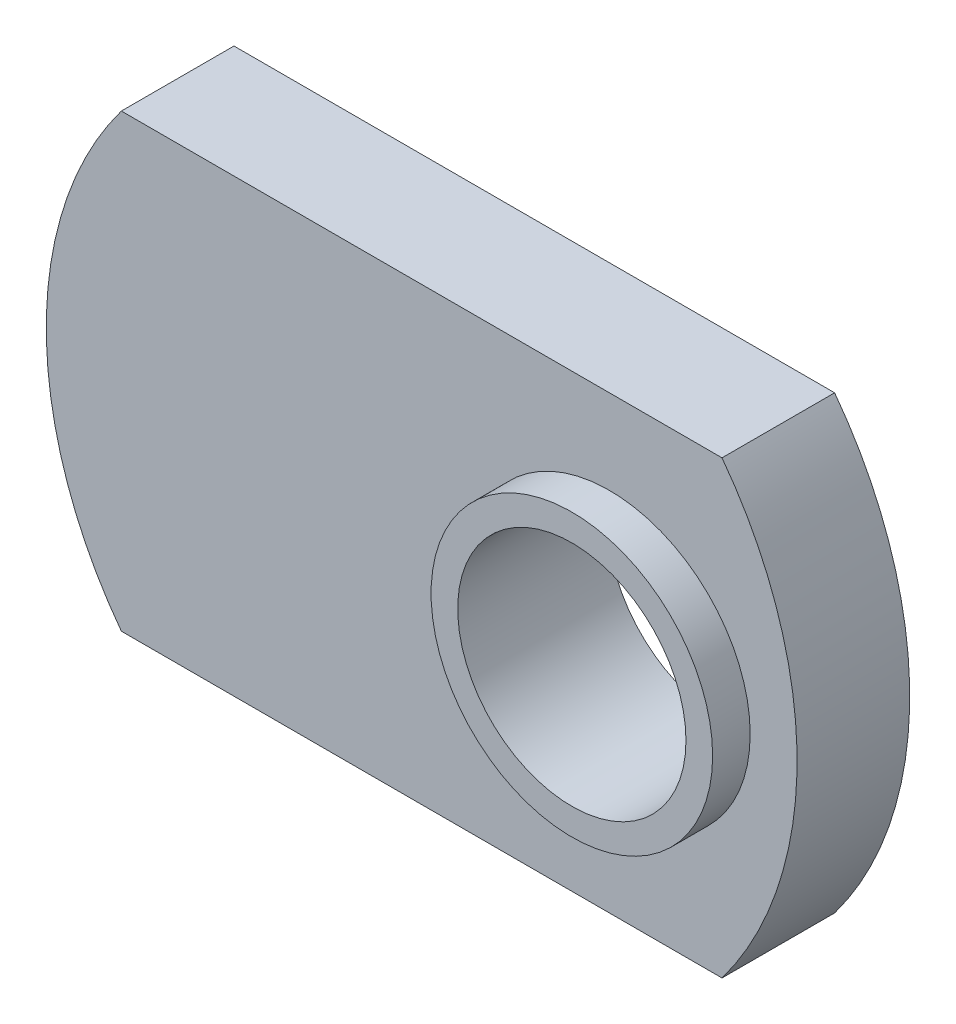
ISO-10303-21;
HEADER;
FILE_DESCRIPTION(('STEP AP214'),'2;1');
FILE_NAME('part.step','',(''),(''),'','','');
FILE_SCHEMA(('AUTOMOTIVE_DESIGN { 1 0 10303 214 1 1 1 1 }'));
ENDSEC;
DATA;
#1=APPLICATION_CONTEXT('core data for automotive mechanical design processes');
#2=APPLICATION_PROTOCOL_DEFINITION('international standard','automotive_design',2000,#1);
#3=PRODUCT_CONTEXT('',#1,'mechanical');
#4=PRODUCT('Part','Part','',(#3));
#5=PRODUCT_RELATED_PRODUCT_CATEGORY('part','',(#4));
#6=PRODUCT_DEFINITION_FORMATION('','',#4);
#7=PRODUCT_DEFINITION_CONTEXT('part definition',#1,'design');
#8=PRODUCT_DEFINITION('design','',#6,#7);
#9=PRODUCT_DEFINITION_SHAPE('','',#8);
#10=(LENGTH_UNIT() NAMED_UNIT(*) SI_UNIT(.MILLI.,.METRE.));
#11=(NAMED_UNIT(*) PLANE_ANGLE_UNIT() SI_UNIT($,.RADIAN.));
#12=(NAMED_UNIT(*) SI_UNIT($,.STERADIAN.) SOLID_ANGLE_UNIT());
#13=UNCERTAINTY_MEASURE_WITH_UNIT(LENGTH_MEASURE(1.E-05),#10,'distance_accuracy_value','');
#14=(GEOMETRIC_REPRESENTATION_CONTEXT(3) GLOBAL_UNCERTAINTY_ASSIGNED_CONTEXT((#13)) GLOBAL_UNIT_ASSIGNED_CONTEXT((#10,
#11,#12)) REPRESENTATION_CONTEXT('',''));
#15=CARTESIAN_POINT('',(0.,0.,0.));
#16=DIRECTION('',(0.,0.,1.));
#17=DIRECTION('',(1.,0.,0.));
#18=AXIS2_PLACEMENT_3D('',#15,#16,#17);
#19=CARTESIAN_POINT('',(0.,0.,2.38125));
#20=DIRECTION('',(0.,0.,1.));
#21=DIRECTION('',(1.,0.,0.));
#22=AXIS2_PLACEMENT_3D('',#19,#20,#21);
#23=PLANE('',#22);
#24=CARTESIAN_POINT('',(0.,0.,2.38125));
#25=DIRECTION('',(0.,0.,1.));
#26=DIRECTION('',(1.,0.,0.));
#27=AXIS2_PLACEMENT_3D('',#24,#25,#26);
#28=CIRCLE('',#27,7.9375);
#29=CARTESIAN_POINT('',(6.35,-4.7625,2.38125));
#30=VERTEX_POINT('',#29);
#31=CARTESIAN_POINT('',(6.35,4.7625,2.38125));
#32=VERTEX_POINT('',#31);
#33=EDGE_CURVE('E85',#30,#32,#28,.T.);
#34=ORIENTED_EDGE('',*,*,#33,.T.);
#35=DIRECTION('',(-1.,0.,0.));
#36=VECTOR('',#35,1.);
#37=CARTESIAN_POINT('',(-6.35,4.7625,2.38125));
#38=LINE('',#37,#36);
#39=CARTESIAN_POINT('',(-6.35,4.7625,2.38125));
#40=VERTEX_POINT('',#39);
#41=EDGE_CURVE('E80',#32,#40,#38,.T.);
#42=ORIENTED_EDGE('',*,*,#41,.T.);
#43=CARTESIAN_POINT('',(0.,0.,2.38125));
#44=DIRECTION('',(0.,0.,1.));
#45=DIRECTION('',(1.,0.,0.));
#46=AXIS2_PLACEMENT_3D('',#43,#44,#45);
#47=CIRCLE('',#46,7.9375);
#48=CARTESIAN_POINT('',(-6.35,-4.7625,2.38125));
#49=VERTEX_POINT('',#48);
#50=EDGE_CURVE('E83',#40,#49,#47,.T.);
#51=ORIENTED_EDGE('',*,*,#50,.T.);
#52=DIRECTION('',(1.,0.,0.));
#53=VECTOR('',#52,1.);
#54=CARTESIAN_POINT('',(-6.35,-4.7625,2.38125));
#55=LINE('',#54,#53);
#56=EDGE_CURVE('E50',#49,#30,#55,.T.);
#57=ORIENTED_EDGE('',*,*,#56,.T.);
#58=EDGE_LOOP('',(#34,#42,#51,#57));
#59=FACE_BOUND('',#58,.T.);
#60=CARTESIAN_POINT('',(3.96875,0.,2.38125));
#61=DIRECTION('',(0.,0.,1.));
#62=DIRECTION('',(1.,0.,0.));
#63=AXIS2_PLACEMENT_3D('',#60,#61,#62);
#64=CIRCLE('',#63,2.9765625);
#65=CARTESIAN_POINT('',(6.9453125,0.,2.38125));
#66=VERTEX_POINT('',#65);
#67=EDGE_CURVE('E115',#66,#66,#64,.T.);
#68=ORIENTED_EDGE('',*,*,#67,.F.);
#69=EDGE_LOOP('',(#68));
#70=FACE_BOUND('',#69,.T.);
#71=ADVANCED_FACE('F33',(#59,#70),#23,.T.);
#72=CARTESIAN_POINT('',(0.,0.,0.));
#73=DIRECTION('',(0.,0.,1.));
#74=DIRECTION('',(1.,0.,0.));
#75=AXIS2_PLACEMENT_3D('',#72,#73,#74);
#76=PLANE('',#75);
#77=CARTESIAN_POINT('',(0.,0.,0.));
#78=DIRECTION('',(0.,0.,1.));
#79=DIRECTION('',(1.,0.,0.));
#80=AXIS2_PLACEMENT_3D('',#77,#78,#79);
#81=CIRCLE('',#80,7.9375);
#82=CARTESIAN_POINT('',(6.35,-4.7625,0.));
#83=VERTEX_POINT('',#82);
#84=CARTESIAN_POINT('',(6.35,4.7625,0.));
#85=VERTEX_POINT('',#84);
#86=EDGE_CURVE('E97',#83,#85,#81,.T.);
#87=ORIENTED_EDGE('',*,*,#86,.F.);
#88=DIRECTION('',(1.,0.,0.));
#89=VECTOR('',#88,1.);
#90=CARTESIAN_POINT('',(-6.35,-4.7625,0.));
#91=LINE('',#90,#89);
#92=CARTESIAN_POINT('',(-6.35,-4.7625,0.));
#93=VERTEX_POINT('',#92);
#94=EDGE_CURVE('E73',#93,#83,#91,.T.);
#95=ORIENTED_EDGE('',*,*,#94,.F.);
#96=CARTESIAN_POINT('',(0.,0.,0.));
#97=DIRECTION('',(0.,0.,1.));
#98=DIRECTION('',(1.,0.,0.));
#99=AXIS2_PLACEMENT_3D('',#96,#97,#98);
#100=CIRCLE('',#99,7.9375);
#101=CARTESIAN_POINT('',(-6.35,4.7625,0.));
#102=VERTEX_POINT('',#101);
#103=EDGE_CURVE('E67',#102,#93,#100,.T.);
#104=ORIENTED_EDGE('',*,*,#103,.F.);
#105=DIRECTION('',(-1.,0.,0.));
#106=VECTOR('',#105,1.);
#107=CARTESIAN_POINT('',(-6.35,4.7625,0.));
#108=LINE('',#107,#106);
#109=EDGE_CURVE('E89',#85,#102,#108,.T.);
#110=ORIENTED_EDGE('',*,*,#109,.F.);
#111=EDGE_LOOP('',(#87,#95,#104,#110));
#112=FACE_BOUND('',#111,.T.);
#113=CARTESIAN_POINT('',(3.96875,0.,0.));
#114=DIRECTION('',(0.,0.,1.));
#115=DIRECTION('',(1.,0.,0.));
#116=AXIS2_PLACEMENT_3D('',#113,#114,#115);
#117=CIRCLE('',#116,2.413);
#118=CARTESIAN_POINT('',(6.38175,0.,0.));
#119=VERTEX_POINT('',#118);
#120=EDGE_CURVE('E100',#119,#119,#117,.T.);
#121=ORIENTED_EDGE('',*,*,#120,.T.);
#122=EDGE_LOOP('',(#121));
#123=FACE_BOUND('',#122,.T.);
#124=ADVANCED_FACE('F108',(#112,#123),#76,.F.);
#125=CARTESIAN_POINT('',(0.,0.,2.38125));
#126=DIRECTION('',(0.,0.,-1.));
#127=DIRECTION('',(-1.,0.,0.));
#128=AXIS2_PLACEMENT_3D('',#125,#126,#127);
#129=CYLINDRICAL_SURFACE('',#128,7.9375);
#130=ORIENTED_EDGE('',*,*,#86,.T.);
#131=DIRECTION('',(0.,0.,-1.));
#132=VECTOR('',#131,1.);
#133=CARTESIAN_POINT('',(6.35,4.7625,2.38125));
#134=LINE('',#133,#132);
#135=EDGE_CURVE('E11',#32,#85,#134,.T.);
#136=ORIENTED_EDGE('',*,*,#135,.F.);
#137=ORIENTED_EDGE('',*,*,#33,.F.);
#138=DIRECTION('',(0.,0.,-1.));
#139=VECTOR('',#138,1.);
#140=CARTESIAN_POINT('',(6.35,-4.7625,2.38125));
#141=LINE('',#140,#139);
#142=EDGE_CURVE('E93',#30,#83,#141,.T.);
#143=ORIENTED_EDGE('',*,*,#142,.T.);
#144=EDGE_LOOP('',(#130,#136,#137,#143));
#145=FACE_BOUND('',#144,.T.);
#146=ADVANCED_FACE('F35',(#145),#129,.T.);
#147=CARTESIAN_POINT('',(-6.35,4.7625,2.38125));
#148=DIRECTION('',(0.,-1.,0.));
#149=DIRECTION('',(0.,0.,-1.));
#150=AXIS2_PLACEMENT_3D('',#147,#148,#149);
#151=PLANE('',#150);
#152=ORIENTED_EDGE('',*,*,#109,.T.);
#153=DIRECTION('',(0.,0.,-1.));
#154=VECTOR('',#153,1.);
#155=CARTESIAN_POINT('',(-6.35,4.7625,2.38125));
#156=LINE('',#155,#154);
#157=EDGE_CURVE('E42',#40,#102,#156,.T.);
#158=ORIENTED_EDGE('',*,*,#157,.F.);
#159=ORIENTED_EDGE('',*,*,#41,.F.);
#160=ORIENTED_EDGE('',*,*,#135,.T.);
#161=EDGE_LOOP('',(#152,#158,#159,#160));
#162=FACE_BOUND('',#161,.T.);
#163=ADVANCED_FACE('F88',(#162),#151,.F.);
#164=CARTESIAN_POINT('',(0.,0.,2.38125));
#165=DIRECTION('',(0.,0.,-1.));
#166=DIRECTION('',(-1.,0.,0.));
#167=AXIS2_PLACEMENT_3D('',#164,#165,#166);
#168=CYLINDRICAL_SURFACE('',#167,7.9375);
#169=ORIENTED_EDGE('',*,*,#103,.T.);
#170=DIRECTION('',(0.,0.,-1.));
#171=VECTOR('',#170,1.);
#172=CARTESIAN_POINT('',(-6.35,-4.7625,2.38125));
#173=LINE('',#172,#171);
#174=EDGE_CURVE('E90',#49,#93,#173,.T.);
#175=ORIENTED_EDGE('',*,*,#174,.F.);
#176=ORIENTED_EDGE('',*,*,#50,.F.);
#177=ORIENTED_EDGE('',*,*,#157,.T.);
#178=EDGE_LOOP('',(#169,#175,#176,#177));
#179=FACE_BOUND('',#178,.T.);
#180=ADVANCED_FACE('F91',(#179),#168,.T.);
#181=CARTESIAN_POINT('',(-6.35,-4.7625,2.38125));
#182=DIRECTION('',(0.,1.,0.));
#183=DIRECTION('',(0.,0.,1.));
#184=AXIS2_PLACEMENT_3D('',#181,#182,#183);
#185=PLANE('',#184);
#186=ORIENTED_EDGE('',*,*,#94,.T.);
#187=ORIENTED_EDGE('',*,*,#142,.F.);
#188=ORIENTED_EDGE('',*,*,#56,.F.);
#189=ORIENTED_EDGE('',*,*,#174,.T.);
#190=EDGE_LOOP('',(#186,#187,#188,#189));
#191=FACE_BOUND('',#190,.T.);
#192=ADVANCED_FACE('F105',(#191),#185,.F.);
#193=CARTESIAN_POINT('',(3.96875,0.,2.38125));
#194=DIRECTION('',(0.,0.,-1.));
#195=DIRECTION('',(-1.,0.,0.));
#196=AXIS2_PLACEMENT_3D('',#193,#194,#195);
#197=CYLINDRICAL_SURFACE('',#196,2.413);
#198=ORIENTED_EDGE('',*,*,#120,.F.);
#199=EDGE_LOOP('',(#198));
#200=FACE_BOUND('',#199,.T.);
#201=CARTESIAN_POINT('',(3.96875,0.,3.175));
#202=DIRECTION('',(0.,0.,1.));
#203=DIRECTION('',(1.,0.,0.));
#204=AXIS2_PLACEMENT_3D('',#201,#202,#203);
#205=CIRCLE('',#204,2.413);
#206=CARTESIAN_POINT('',(6.38175,0.,3.175));
#207=VERTEX_POINT('',#206);
#208=EDGE_CURVE('E118',#207,#207,#205,.T.);
#209=ORIENTED_EDGE('',*,*,#208,.T.);
#210=EDGE_LOOP('',(#209));
#211=FACE_BOUND('',#210,.T.);
#212=ADVANCED_FACE('F124',(#200,#211),#197,.F.);
#213=CARTESIAN_POINT('',(3.96875,0.,3.175));
#214=DIRECTION('',(0.,0.,1.));
#215=DIRECTION('',(1.,0.,0.));
#216=AXIS2_PLACEMENT_3D('',#213,#214,#215);
#217=PLANE('',#216);
#218=CARTESIAN_POINT('',(3.96875,0.,3.175));
#219=DIRECTION('',(0.,0.,1.));
#220=DIRECTION('',(1.,0.,0.));
#221=AXIS2_PLACEMENT_3D('',#218,#219,#220);
#222=CIRCLE('',#221,2.9765625);
#223=CARTESIAN_POINT('',(6.9453125,0.,3.175));
#224=VERTEX_POINT('',#223);
#225=EDGE_CURVE('E114',#224,#224,#222,.T.);
#226=ORIENTED_EDGE('',*,*,#225,.T.);
#227=EDGE_LOOP('',(#226));
#228=FACE_BOUND('',#227,.T.);
#229=ORIENTED_EDGE('',*,*,#208,.F.);
#230=EDGE_LOOP('',(#229));
#231=FACE_BOUND('',#230,.T.);
#232=ADVANCED_FACE('F126',(#228,#231),#217,.T.);
#233=CARTESIAN_POINT('',(3.96875,0.,3.175));
#234=DIRECTION('',(0.,0.,-1.));
#235=DIRECTION('',(-1.,0.,0.));
#236=AXIS2_PLACEMENT_3D('',#233,#234,#235);
#237=CYLINDRICAL_SURFACE('',#236,2.9765625);
#238=ORIENTED_EDGE('',*,*,#225,.F.);
#239=EDGE_LOOP('',(#238));
#240=FACE_BOUND('',#239,.T.);
#241=ORIENTED_EDGE('',*,*,#67,.T.);
#242=EDGE_LOOP('',(#241));
#243=FACE_BOUND('',#242,.T.);
#244=ADVANCED_FACE('F128',(#240,#243),#237,.T.);
#245=CLOSED_SHELL('',(#71,#124,#146,#163,#180,#192,#212,#232,#244));
#246=MANIFOLD_SOLID_BREP('B2',#245);
#247=ADVANCED_BREP_SHAPE_REPRESENTATION('',(#18,#246),#14);
#248=SHAPE_DEFINITION_REPRESENTATION(#9,#247);
ENDSEC;
END-ISO-10303-21;
